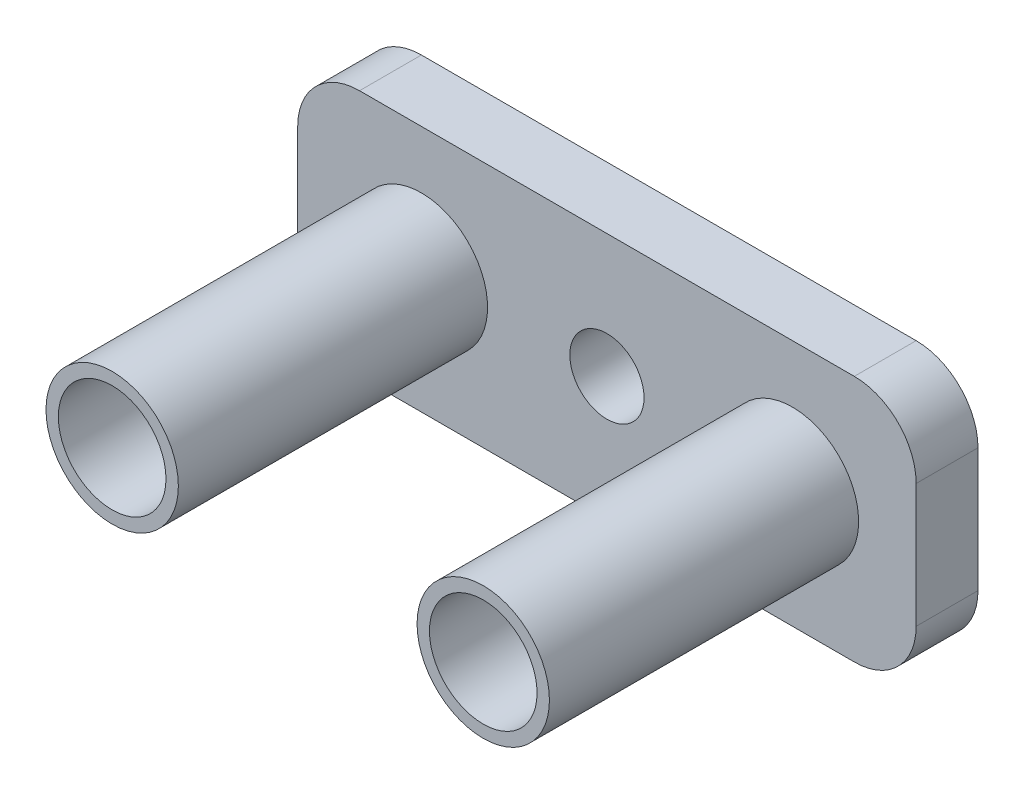
ISO-10303-21;
HEADER;
FILE_DESCRIPTION(('STEP AP214'),'2;1');
FILE_NAME('part.step','',(''),(''),'','','');
FILE_SCHEMA(('AUTOMOTIVE_DESIGN { 1 0 10303 214 1 1 1 1 }'));
ENDSEC;
DATA;
#1=APPLICATION_CONTEXT('core data for automotive mechanical design processes');
#2=APPLICATION_PROTOCOL_DEFINITION('international standard','automotive_design',2000,#1);
#3=PRODUCT_CONTEXT('',#1,'mechanical');
#4=PRODUCT('Part','Part','',(#3));
#5=PRODUCT_RELATED_PRODUCT_CATEGORY('part','',(#4));
#6=PRODUCT_DEFINITION_FORMATION('','',#4);
#7=PRODUCT_DEFINITION_CONTEXT('part definition',#1,'design');
#8=PRODUCT_DEFINITION('design','',#6,#7);
#9=PRODUCT_DEFINITION_SHAPE('','',#8);
#10=(LENGTH_UNIT() NAMED_UNIT(*) SI_UNIT(.MILLI.,.METRE.));
#11=(NAMED_UNIT(*) PLANE_ANGLE_UNIT() SI_UNIT($,.RADIAN.));
#12=(NAMED_UNIT(*) SI_UNIT($,.STERADIAN.) SOLID_ANGLE_UNIT());
#13=UNCERTAINTY_MEASURE_WITH_UNIT(LENGTH_MEASURE(1.E-05),#10,'distance_accuracy_value','');
#14=(GEOMETRIC_REPRESENTATION_CONTEXT(3) GLOBAL_UNCERTAINTY_ASSIGNED_CONTEXT((#13)) GLOBAL_UNIT_ASSIGNED_CONTEXT((#10,
#11,#12)) REPRESENTATION_CONTEXT('',''));
#15=CARTESIAN_POINT('',(0.,0.,0.));
#16=DIRECTION('',(0.,0.,1.));
#17=DIRECTION('',(1.,0.,0.));
#18=AXIS2_PLACEMENT_3D('',#15,#16,#17);
#19=CARTESIAN_POINT('',(-14.0298507462687,1.62313432835821,5.));
#20=DIRECTION('',(0.,0.,-1.));
#21=DIRECTION('',(-1.,0.,0.));
#22=AXIS2_PLACEMENT_3D('',#19,#20,#21);
#23=PLANE('',#22);
#24=CARTESIAN_POINT('',(20.9701492537313,-3.37686567164179,5.));
#25=DIRECTION('',(0.,0.,-1.));
#26=DIRECTION('',(-1.,0.,0.));
#27=AXIS2_PLACEMENT_3D('',#24,#25,#26);
#28=CIRCLE('',#27,5.35);
#29=CARTESIAN_POINT('',(15.6201492537314,-3.37686567164179,5.));
#30=VERTEX_POINT('',#29);
#31=EDGE_CURVE('E12',#30,#30,#28,.F.);
#32=ORIENTED_EDGE('',*,*,#31,.F.);
#33=EDGE_LOOP('',(#32));
#34=FACE_BOUND('',#33,.T.);
#35=CARTESIAN_POINT('',(-9.02985074626865,-3.37686567164179,5.));
#36=DIRECTION('',(0.,0.,-1.));
#37=DIRECTION('',(-1.,0.,0.));
#38=AXIS2_PLACEMENT_3D('',#35,#36,#37);
#39=CIRCLE('',#38,5.35);
#40=CARTESIAN_POINT('',(-14.3798507462686,-3.37686567164179,5.));
#41=VERTEX_POINT('',#40);
#42=EDGE_CURVE('E58',#41,#41,#39,.F.);
#43=ORIENTED_EDGE('',*,*,#42,.F.);
#44=EDGE_LOOP('',(#43));
#45=FACE_BOUND('',#44,.T.);
#46=CARTESIAN_POINT('',(-14.0298507462687,1.62313432835821,5.));
#47=DIRECTION('',(0.,0.,1.));
#48=DIRECTION('',(-1.,0.,0.));
#49=AXIS2_PLACEMENT_3D('',#46,#47,#48);
#50=CIRCLE('',#49,5.);
#51=CARTESIAN_POINT('',(-14.0298507462686,6.62313432835821,5.));
#52=VERTEX_POINT('',#51);
#53=CARTESIAN_POINT('',(-19.0298507462687,1.62313432835817,5.));
#54=VERTEX_POINT('',#53);
#55=EDGE_CURVE('E163',#52,#54,#50,.T.);
#56=ORIENTED_EDGE('',*,*,#55,.T.);
#57=DIRECTION('',(0.,-1.,0.));
#58=VECTOR('',#57,1.);
#59=CARTESIAN_POINT('',(-19.0298507462687,1.62313432835817,5.));
#60=LINE('',#59,#58);
#61=CARTESIAN_POINT('',(-19.0298507462687,-8.37686567164175,5.));
#62=VERTEX_POINT('',#61);
#63=EDGE_CURVE('E111',#54,#62,#60,.T.);
#64=ORIENTED_EDGE('',*,*,#63,.T.);
#65=CARTESIAN_POINT('',(-14.0298507462687,-8.37686567164179,5.));
#66=DIRECTION('',(0.,0.,1.));
#67=DIRECTION('',(-1.,0.,0.));
#68=AXIS2_PLACEMENT_3D('',#65,#66,#67);
#69=CIRCLE('',#68,5.);
#70=CARTESIAN_POINT('',(-14.0298507462686,-13.3768656716418,5.));
#71=VERTEX_POINT('',#70);
#72=EDGE_CURVE('E193',#62,#71,#69,.T.);
#73=ORIENTED_EDGE('',*,*,#72,.T.);
#74=DIRECTION('',(1.,0.,0.));
#75=VECTOR('',#74,1.);
#76=CARTESIAN_POINT('',(-14.0298507462686,-13.3768656716418,5.));
#77=LINE('',#76,#75);
#78=CARTESIAN_POINT('',(25.9701492537313,-13.3768656716418,5.));
#79=VERTEX_POINT('',#78);
#80=EDGE_CURVE('E195',#71,#79,#77,.T.);
#81=ORIENTED_EDGE('',*,*,#80,.T.);
#82=CARTESIAN_POINT('',(25.9701492537314,-8.37686567164179,5.));
#83=DIRECTION('',(0.,0.,1.));
#84=DIRECTION('',(1.,0.,0.));
#85=AXIS2_PLACEMENT_3D('',#82,#83,#84);
#86=CIRCLE('',#85,5.);
#87=CARTESIAN_POINT('',(30.9701492537314,-8.37686567164179,5.));
#88=VERTEX_POINT('',#87);
#89=EDGE_CURVE('E130',#79,#88,#86,.T.);
#90=ORIENTED_EDGE('',*,*,#89,.T.);
#91=DIRECTION('',(0.,1.,0.));
#92=VECTOR('',#91,1.);
#93=CARTESIAN_POINT('',(30.9701492537313,1.62313432835817,5.));
#94=LINE('',#93,#92);
#95=CARTESIAN_POINT('',(30.9701492537313,1.62313432835817,5.));
#96=VERTEX_POINT('',#95);
#97=EDGE_CURVE('E124',#88,#96,#94,.T.);
#98=ORIENTED_EDGE('',*,*,#97,.T.);
#99=CARTESIAN_POINT('',(25.9701492537313,1.62313432835821,5.));
#100=DIRECTION('',(0.,0.,1.));
#101=DIRECTION('',(1.,0.,0.));
#102=AXIS2_PLACEMENT_3D('',#99,#100,#101);
#103=CIRCLE('',#102,5.);
#104=CARTESIAN_POINT('',(25.9701492537313,6.62313432835821,5.));
#105=VERTEX_POINT('',#104);
#106=EDGE_CURVE('E128',#96,#105,#103,.T.);
#107=ORIENTED_EDGE('',*,*,#106,.T.);
#108=DIRECTION('',(-1.,0.,0.));
#109=VECTOR('',#108,1.);
#110=CARTESIAN_POINT('',(-14.0298507462686,6.62313432835821,5.));
#111=LINE('',#110,#109);
#112=EDGE_CURVE('E67',#105,#52,#111,.T.);
#113=ORIENTED_EDGE('',*,*,#112,.T.);
#114=EDGE_LOOP('',(#56,#64,#73,#81,#90,#98,#107,#113));
#115=FACE_BOUND('',#114,.T.);
#116=CARTESIAN_POINT('',(5.97014925373135,-3.37686567164179,5.));
#117=DIRECTION('',(0.,0.,1.));
#118=DIRECTION('',(1.,0.,0.));
#119=AXIS2_PLACEMENT_3D('',#116,#117,#118);
#120=CIRCLE('',#119,3.);
#121=CARTESIAN_POINT('',(8.97014925373134,-3.37686567164179,5.));
#122=VERTEX_POINT('',#121);
#123=EDGE_CURVE('E152',#122,#122,#120,.T.);
#124=ORIENTED_EDGE('',*,*,#123,.F.);
#125=EDGE_LOOP('',(#124));
#126=FACE_BOUND('',#125,.T.);
#127=ADVANCED_FACE('F48',(#34,#45,#115,#126),#23,.F.);
#128=CARTESIAN_POINT('',(-14.0298507462687,1.62313432835821,0.));
#129=DIRECTION('',(0.,0.,-1.));
#130=DIRECTION('',(-1.,0.,0.));
#131=AXIS2_PLACEMENT_3D('',#128,#129,#130);
#132=PLANE('',#131);
#133=CARTESIAN_POINT('',(-14.0298507462687,1.62313432835821,0.));
#134=DIRECTION('',(0.,0.,1.));
#135=DIRECTION('',(-1.,0.,0.));
#136=AXIS2_PLACEMENT_3D('',#133,#134,#135);
#137=CIRCLE('',#136,5.);
#138=CARTESIAN_POINT('',(-14.0298507462686,6.62313432835821,0.));
#139=VERTEX_POINT('',#138);
#140=CARTESIAN_POINT('',(-19.0298507462687,1.62313432835817,0.));
#141=VERTEX_POINT('',#140);
#142=EDGE_CURVE('E148',#139,#141,#137,.T.);
#143=ORIENTED_EDGE('',*,*,#142,.F.);
#144=DIRECTION('',(-1.,0.,0.));
#145=VECTOR('',#144,1.);
#146=CARTESIAN_POINT('',(-14.0298507462686,6.62313432835821,0.));
#147=LINE('',#146,#145);
#148=CARTESIAN_POINT('',(25.9701492537313,6.62313432835821,0.));
#149=VERTEX_POINT('',#148);
#150=EDGE_CURVE('E102',#149,#139,#147,.T.);
#151=ORIENTED_EDGE('',*,*,#150,.F.);
#152=CARTESIAN_POINT('',(25.9701492537313,1.62313432835821,0.));
#153=DIRECTION('',(0.,0.,1.));
#154=DIRECTION('',(1.,0.,0.));
#155=AXIS2_PLACEMENT_3D('',#152,#153,#154);
#156=CIRCLE('',#155,5.);
#157=CARTESIAN_POINT('',(30.9701492537313,1.62313432835817,0.));
#158=VERTEX_POINT('',#157);
#159=EDGE_CURVE('E96',#158,#149,#156,.T.);
#160=ORIENTED_EDGE('',*,*,#159,.F.);
#161=DIRECTION('',(0.,1.,0.));
#162=VECTOR('',#161,1.);
#163=CARTESIAN_POINT('',(30.9701492537313,1.62313432835817,0.));
#164=LINE('',#163,#162);
#165=CARTESIAN_POINT('',(30.9701492537314,-8.37686567164179,0.));
#166=VERTEX_POINT('',#165);
#167=EDGE_CURVE('E138',#166,#158,#164,.T.);
#168=ORIENTED_EDGE('',*,*,#167,.F.);
#169=CARTESIAN_POINT('',(25.9701492537314,-8.37686567164179,0.));
#170=DIRECTION('',(0.,0.,1.));
#171=DIRECTION('',(1.,0.,0.));
#172=AXIS2_PLACEMENT_3D('',#169,#170,#171);
#173=CIRCLE('',#172,5.);
#174=CARTESIAN_POINT('',(25.9701492537313,-13.3768656716418,0.));
#175=VERTEX_POINT('',#174);
#176=EDGE_CURVE('E158',#175,#166,#173,.T.);
#177=ORIENTED_EDGE('',*,*,#176,.F.);
#178=DIRECTION('',(1.,0.,0.));
#179=VECTOR('',#178,1.);
#180=CARTESIAN_POINT('',(-14.0298507462686,-13.3768656716418,0.));
#181=LINE('',#180,#179);
#182=CARTESIAN_POINT('',(-14.0298507462686,-13.3768656716418,0.));
#183=VERTEX_POINT('',#182);
#184=EDGE_CURVE('E156',#183,#175,#181,.T.);
#185=ORIENTED_EDGE('',*,*,#184,.F.);
#186=CARTESIAN_POINT('',(-14.0298507462687,-8.37686567164179,0.));
#187=DIRECTION('',(0.,0.,1.));
#188=DIRECTION('',(-1.,0.,0.));
#189=AXIS2_PLACEMENT_3D('',#186,#187,#188);
#190=CIRCLE('',#189,5.);
#191=CARTESIAN_POINT('',(-19.0298507462687,-8.37686567164175,0.));
#192=VERTEX_POINT('',#191);
#193=EDGE_CURVE('E154',#192,#183,#190,.T.);
#194=ORIENTED_EDGE('',*,*,#193,.F.);
#195=DIRECTION('',(0.,-1.,0.));
#196=VECTOR('',#195,1.);
#197=CARTESIAN_POINT('',(-19.0298507462687,1.62313432835817,0.));
#198=LINE('',#197,#196);
#199=EDGE_CURVE('E151',#141,#192,#198,.T.);
#200=ORIENTED_EDGE('',*,*,#199,.F.);
#201=EDGE_LOOP('',(#143,#151,#160,#168,#177,#185,#194,#200));
#202=FACE_BOUND('',#201,.T.);
#203=CARTESIAN_POINT('',(5.97014925373135,-3.37686567164179,0.));
#204=DIRECTION('',(0.,0.,1.));
#205=DIRECTION('',(1.,0.,0.));
#206=AXIS2_PLACEMENT_3D('',#203,#204,#205);
#207=CIRCLE('',#206,3.);
#208=CARTESIAN_POINT('',(8.97014925373134,-3.37686567164179,0.));
#209=VERTEX_POINT('',#208);
#210=EDGE_CURVE('E188',#209,#209,#207,.T.);
#211=ORIENTED_EDGE('',*,*,#210,.T.);
#212=EDGE_LOOP('',(#211));
#213=FACE_BOUND('',#212,.T.);
#214=ADVANCED_FACE('F207',(#202,#213),#132,.T.);
#215=CARTESIAN_POINT('',(-14.0298507462687,1.62313432835821,5.));
#216=DIRECTION('',(0.,0.,-1.));
#217=DIRECTION('',(-1.,0.,0.));
#218=AXIS2_PLACEMENT_3D('',#215,#216,#217);
#219=CYLINDRICAL_SURFACE('',#218,5.);
#220=ORIENTED_EDGE('',*,*,#142,.T.);
#221=DIRECTION('',(0.,0.,-1.));
#222=VECTOR('',#221,1.);
#223=CARTESIAN_POINT('',(-19.0298507462687,1.62313432835817,5.));
#224=LINE('',#223,#222);
#225=EDGE_CURVE('E52',#54,#141,#224,.T.);
#226=ORIENTED_EDGE('',*,*,#225,.F.);
#227=ORIENTED_EDGE('',*,*,#55,.F.);
#228=DIRECTION('',(0.,0.,-1.));
#229=VECTOR('',#228,1.);
#230=CARTESIAN_POINT('',(-14.0298507462686,6.62313432835821,5.));
#231=LINE('',#230,#229);
#232=EDGE_CURVE('E144',#52,#139,#231,.T.);
#233=ORIENTED_EDGE('',*,*,#232,.T.);
#234=EDGE_LOOP('',(#220,#226,#227,#233));
#235=FACE_BOUND('',#234,.T.);
#236=ADVANCED_FACE('F50',(#235),#219,.T.);
#237=CARTESIAN_POINT('',(-19.0298507462687,1.62313432835817,5.));
#238=DIRECTION('',(1.,0.,0.));
#239=DIRECTION('',(0.,1.,0.));
#240=AXIS2_PLACEMENT_3D('',#237,#238,#239);
#241=PLANE('',#240);
#242=ORIENTED_EDGE('',*,*,#199,.T.);
#243=DIRECTION('',(0.,0.,-1.));
#244=VECTOR('',#243,1.);
#245=CARTESIAN_POINT('',(-19.0298507462687,-8.37686567164175,5.));
#246=LINE('',#245,#244);
#247=EDGE_CURVE('E172',#62,#192,#246,.T.);
#248=ORIENTED_EDGE('',*,*,#247,.F.);
#249=ORIENTED_EDGE('',*,*,#63,.F.);
#250=ORIENTED_EDGE('',*,*,#225,.T.);
#251=EDGE_LOOP('',(#242,#248,#249,#250));
#252=FACE_BOUND('',#251,.T.);
#253=ADVANCED_FACE('F417',(#252),#241,.F.);
#254=CARTESIAN_POINT('',(-14.0298507462687,-8.37686567164179,5.));
#255=DIRECTION('',(0.,0.,-1.));
#256=DIRECTION('',(-1.,0.,0.));
#257=AXIS2_PLACEMENT_3D('',#254,#255,#256);
#258=CYLINDRICAL_SURFACE('',#257,5.);
#259=ORIENTED_EDGE('',*,*,#193,.T.);
#260=DIRECTION('',(0.,0.,-1.));
#261=VECTOR('',#260,1.);
#262=CARTESIAN_POINT('',(-14.0298507462686,-13.3768656716418,5.));
#263=LINE('',#262,#261);
#264=EDGE_CURVE('E170',#71,#183,#263,.T.);
#265=ORIENTED_EDGE('',*,*,#264,.F.);
#266=ORIENTED_EDGE('',*,*,#72,.F.);
#267=ORIENTED_EDGE('',*,*,#247,.T.);
#268=EDGE_LOOP('',(#259,#265,#266,#267));
#269=FACE_BOUND('',#268,.T.);
#270=ADVANCED_FACE('F408',(#269),#258,.T.);
#271=CARTESIAN_POINT('',(-14.0298507462686,-13.3768656716418,5.));
#272=DIRECTION('',(0.,1.,0.));
#273=DIRECTION('',(0.,0.,1.));
#274=AXIS2_PLACEMENT_3D('',#271,#272,#273);
#275=PLANE('',#274);
#276=ORIENTED_EDGE('',*,*,#184,.T.);
#277=DIRECTION('',(0.,0.,-1.));
#278=VECTOR('',#277,1.);
#279=CARTESIAN_POINT('',(25.9701492537313,-13.3768656716418,5.));
#280=LINE('',#279,#278);
#281=EDGE_CURVE('E167',#79,#175,#280,.T.);
#282=ORIENTED_EDGE('',*,*,#281,.F.);
#283=ORIENTED_EDGE('',*,*,#80,.F.);
#284=ORIENTED_EDGE('',*,*,#264,.T.);
#285=EDGE_LOOP('',(#276,#282,#283,#284));
#286=FACE_BOUND('',#285,.T.);
#287=ADVANCED_FACE('F200',(#286),#275,.F.);
#288=CARTESIAN_POINT('',(25.9701492537314,-8.37686567164179,5.));
#289=DIRECTION('',(0.,0.,-1.));
#290=DIRECTION('',(-1.,0.,0.));
#291=AXIS2_PLACEMENT_3D('',#288,#289,#290);
#292=CYLINDRICAL_SURFACE('',#291,5.);
#293=ORIENTED_EDGE('',*,*,#176,.T.);
#294=DIRECTION('',(0.,0.,-1.));
#295=VECTOR('',#294,1.);
#296=CARTESIAN_POINT('',(30.9701492537314,-8.37686567164179,5.));
#297=LINE('',#296,#295);
#298=EDGE_CURVE('E139',#88,#166,#297,.T.);
#299=ORIENTED_EDGE('',*,*,#298,.F.);
#300=ORIENTED_EDGE('',*,*,#89,.F.);
#301=ORIENTED_EDGE('',*,*,#281,.T.);
#302=EDGE_LOOP('',(#293,#299,#300,#301));
#303=FACE_BOUND('',#302,.T.);
#304=ADVANCED_FACE('F204',(#303),#292,.T.);
#305=CARTESIAN_POINT('',(30.9701492537313,1.62313432835817,5.));
#306=DIRECTION('',(-1.,0.,0.));
#307=DIRECTION('',(0.,-1.,0.));
#308=AXIS2_PLACEMENT_3D('',#305,#306,#307);
#309=PLANE('',#308);
#310=ORIENTED_EDGE('',*,*,#167,.T.);
#311=DIRECTION('',(0.,0.,-1.));
#312=VECTOR('',#311,1.);
#313=CARTESIAN_POINT('',(30.9701492537313,1.62313432835817,5.));
#314=LINE('',#313,#312);
#315=EDGE_CURVE('E135',#96,#158,#314,.T.);
#316=ORIENTED_EDGE('',*,*,#315,.F.);
#317=ORIENTED_EDGE('',*,*,#97,.F.);
#318=ORIENTED_EDGE('',*,*,#298,.T.);
#319=EDGE_LOOP('',(#310,#316,#317,#318));
#320=FACE_BOUND('',#319,.T.);
#321=ADVANCED_FACE('F136',(#320),#309,.F.);
#322=CARTESIAN_POINT('',(25.9701492537313,1.62313432835821,5.));
#323=DIRECTION('',(0.,0.,-1.));
#324=DIRECTION('',(-1.,0.,0.));
#325=AXIS2_PLACEMENT_3D('',#322,#323,#324);
#326=CYLINDRICAL_SURFACE('',#325,5.);
#327=ORIENTED_EDGE('',*,*,#159,.T.);
#328=DIRECTION('',(0.,0.,-1.));
#329=VECTOR('',#328,1.);
#330=CARTESIAN_POINT('',(25.9701492537313,6.62313432835821,5.));
#331=LINE('',#330,#329);
#332=EDGE_CURVE('E140',#105,#149,#331,.T.);
#333=ORIENTED_EDGE('',*,*,#332,.F.);
#334=ORIENTED_EDGE('',*,*,#106,.F.);
#335=ORIENTED_EDGE('',*,*,#315,.T.);
#336=EDGE_LOOP('',(#327,#333,#334,#335));
#337=FACE_BOUND('',#336,.T.);
#338=ADVANCED_FACE('F142',(#337),#326,.T.);
#339=CARTESIAN_POINT('',(-14.0298507462686,6.62313432835821,5.));
#340=DIRECTION('',(0.,-1.,0.));
#341=DIRECTION('',(0.,0.,-1.));
#342=AXIS2_PLACEMENT_3D('',#339,#340,#341);
#343=PLANE('',#342);
#344=ORIENTED_EDGE('',*,*,#150,.T.);
#345=ORIENTED_EDGE('',*,*,#232,.F.);
#346=ORIENTED_EDGE('',*,*,#112,.F.);
#347=ORIENTED_EDGE('',*,*,#332,.T.);
#348=EDGE_LOOP('',(#344,#345,#346,#347));
#349=FACE_BOUND('',#348,.T.);
#350=ADVANCED_FACE('F211',(#349),#343,.F.);
#351=CARTESIAN_POINT('',(5.97014925373135,-3.37686567164179,5.));
#352=DIRECTION('',(0.,0.,-1.));
#353=DIRECTION('',(-1.,0.,0.));
#354=AXIS2_PLACEMENT_3D('',#351,#352,#353);
#355=CYLINDRICAL_SURFACE('',#354,3.);
#356=ORIENTED_EDGE('',*,*,#123,.T.);
#357=EDGE_LOOP('',(#356));
#358=FACE_BOUND('',#357,.T.);
#359=ORIENTED_EDGE('',*,*,#210,.F.);
#360=EDGE_LOOP('',(#359));
#361=FACE_BOUND('',#360,.T.);
#362=ADVANCED_FACE('F213',(#358,#361),#355,.F.);
#363=CARTESIAN_POINT('',(-9.02985074626865,-3.37686567164179,30.));
#364=DIRECTION('',(0.,0.,-1.));
#365=DIRECTION('',(-1.,0.,0.));
#366=AXIS2_PLACEMENT_3D('',#363,#364,#365);
#367=CYLINDRICAL_SURFACE('',#366,5.35);
#368=CARTESIAN_POINT('',(-9.02985074626865,-3.37686567164179,30.));
#369=DIRECTION('',(0.,0.,1.));
#370=DIRECTION('',(1.,0.,0.));
#371=AXIS2_PLACEMENT_3D('',#368,#369,#370);
#372=CIRCLE('',#371,5.35);
#373=CARTESIAN_POINT('',(-3.67985074626865,-3.37686567164179,30.));
#374=VERTEX_POINT('',#373);
#375=EDGE_CURVE('E254',#374,#374,#372,.T.);
#376=ORIENTED_EDGE('',*,*,#375,.F.);
#377=EDGE_LOOP('',(#376));
#378=FACE_BOUND('',#377,.T.);
#379=ORIENTED_EDGE('',*,*,#42,.T.);
#380=EDGE_LOOP('',(#379));
#381=FACE_BOUND('',#380,.T.);
#382=ADVANCED_FACE('F219',(#378,#381),#367,.T.);
#383=CARTESIAN_POINT('',(-9.02985074626865,-3.37686567164179,30.));
#384=DIRECTION('',(0.,0.,-1.));
#385=DIRECTION('',(-1.,0.,0.));
#386=AXIS2_PLACEMENT_3D('',#383,#384,#385);
#387=CYLINDRICAL_SURFACE('',#386,4.35);
#388=CARTESIAN_POINT('',(-9.02985074626865,-3.37686567164179,30.));
#389=DIRECTION('',(0.,0.,1.));
#390=DIRECTION('',(1.,0.,0.));
#391=AXIS2_PLACEMENT_3D('',#388,#389,#390);
#392=CIRCLE('',#391,4.35);
#393=CARTESIAN_POINT('',(-4.67985074626865,-3.37686567164179,30.));
#394=VERTEX_POINT('',#393);
#395=EDGE_CURVE('E256',#394,#394,#392,.T.);
#396=ORIENTED_EDGE('',*,*,#395,.T.);
#397=EDGE_LOOP('',(#396));
#398=FACE_BOUND('',#397,.T.);
#399=CARTESIAN_POINT('',(-9.02985074626865,-3.37686567164179,5.));
#400=DIRECTION('',(0.,0.,-1.));
#401=DIRECTION('',(-1.,0.,0.));
#402=AXIS2_PLACEMENT_3D('',#399,#400,#401);
#403=CIRCLE('',#402,4.35);
#404=CARTESIAN_POINT('',(-13.3798507462687,-3.37686567164179,5.));
#405=VERTEX_POINT('',#404);
#406=EDGE_CURVE('E184',#405,#405,#403,.F.);
#407=ORIENTED_EDGE('',*,*,#406,.F.);
#408=EDGE_LOOP('',(#407));
#409=FACE_BOUND('',#408,.T.);
#410=ADVANCED_FACE('F248',(#398,#409),#387,.F.);
#411=CARTESIAN_POINT('',(-9.02985074626865,-3.37686567164179,30.));
#412=DIRECTION('',(0.,0.,1.));
#413=DIRECTION('',(1.,0.,0.));
#414=AXIS2_PLACEMENT_3D('',#411,#412,#413);
#415=PLANE('',#414);
#416=ORIENTED_EDGE('',*,*,#375,.T.);
#417=EDGE_LOOP('',(#416));
#418=FACE_BOUND('',#417,.T.);
#419=ORIENTED_EDGE('',*,*,#395,.F.);
#420=EDGE_LOOP('',(#419));
#421=FACE_BOUND('',#420,.T.);
#422=ADVANCED_FACE('F239',(#418,#421),#415,.T.);
#423=ORIENTED_EDGE('',*,*,#406,.T.);
#424=EDGE_LOOP('',(#423));
#425=FACE_BOUND('',#424,.T.);
#426=ADVANCED_FACE('F228',(#425),#23,.F.);
#427=CARTESIAN_POINT('',(20.9701492537313,-3.37686567164179,30.));
#428=DIRECTION('',(0.,0.,-1.));
#429=DIRECTION('',(-1.,0.,0.));
#430=AXIS2_PLACEMENT_3D('',#427,#428,#429);
#431=CYLINDRICAL_SURFACE('',#430,5.35);
#432=CARTESIAN_POINT('',(20.9701492537313,-3.37686567164179,30.));
#433=DIRECTION('',(0.,0.,1.));
#434=DIRECTION('',(1.,0.,0.));
#435=AXIS2_PLACEMENT_3D('',#432,#433,#434);
#436=CIRCLE('',#435,5.35);
#437=CARTESIAN_POINT('',(26.3201492537313,-3.37686567164179,30.));
#438=VERTEX_POINT('',#437);
#439=EDGE_CURVE('E264',#438,#438,#436,.T.);
#440=ORIENTED_EDGE('',*,*,#439,.F.);
#441=EDGE_LOOP('',(#440));
#442=FACE_BOUND('',#441,.T.);
#443=ORIENTED_EDGE('',*,*,#31,.T.);
#444=EDGE_LOOP('',(#443));
#445=FACE_BOUND('',#444,.T.);
#446=ADVANCED_FACE('F238',(#442,#445),#431,.T.);
#447=CARTESIAN_POINT('',(20.9701492537313,-3.37686567164179,30.));
#448=DIRECTION('',(0.,0.,-1.));
#449=DIRECTION('',(-1.,0.,0.));
#450=AXIS2_PLACEMENT_3D('',#447,#448,#449);
#451=CYLINDRICAL_SURFACE('',#450,4.35);
#452=CARTESIAN_POINT('',(20.9701492537313,-3.37686567164179,30.));
#453=DIRECTION('',(0.,0.,1.));
#454=DIRECTION('',(1.,0.,0.));
#455=AXIS2_PLACEMENT_3D('',#452,#453,#454);
#456=CIRCLE('',#455,4.35);
#457=CARTESIAN_POINT('',(25.3201492537313,-3.37686567164179,30.));
#458=VERTEX_POINT('',#457);
#459=EDGE_CURVE('E267',#458,#458,#456,.T.);
#460=ORIENTED_EDGE('',*,*,#459,.T.);
#461=EDGE_LOOP('',(#460));
#462=FACE_BOUND('',#461,.T.);
#463=CARTESIAN_POINT('',(20.9701492537313,-3.37686567164179,5.));
#464=DIRECTION('',(0.,0.,-1.));
#465=DIRECTION('',(-1.,0.,0.));
#466=AXIS2_PLACEMENT_3D('',#463,#464,#465);
#467=CIRCLE('',#466,4.35);
#468=CARTESIAN_POINT('',(16.6201492537313,-3.37686567164179,5.));
#469=VERTEX_POINT('',#468);
#470=EDGE_CURVE('E259',#469,#469,#467,.F.);
#471=ORIENTED_EDGE('',*,*,#470,.F.);
#472=EDGE_LOOP('',(#471));
#473=FACE_BOUND('',#472,.T.);
#474=ADVANCED_FACE('F245',(#462,#473),#451,.F.);
#475=CARTESIAN_POINT('',(20.9701492537313,-3.37686567164179,30.));
#476=DIRECTION('',(0.,0.,1.));
#477=DIRECTION('',(1.,0.,0.));
#478=AXIS2_PLACEMENT_3D('',#475,#476,#477);
#479=PLANE('',#478);
#480=ORIENTED_EDGE('',*,*,#439,.T.);
#481=EDGE_LOOP('',(#480));
#482=FACE_BOUND('',#481,.T.);
#483=ORIENTED_EDGE('',*,*,#459,.F.);
#484=EDGE_LOOP('',(#483));
#485=FACE_BOUND('',#484,.T.);
#486=ADVANCED_FACE('F235',(#482,#485),#479,.T.);
#487=ORIENTED_EDGE('',*,*,#470,.T.);
#488=EDGE_LOOP('',(#487));
#489=FACE_BOUND('',#488,.T.);
#490=ADVANCED_FACE('F227',(#489),#23,.F.);
#491=CLOSED_SHELL('',(#127,#214,#236,#253,#270,#287,#304,#321,#338,#350,#362,#382,#410,#422,
#426,#446,#474,#486,#490));
#492=MANIFOLD_SOLID_BREP('B2',#491);
#493=ADVANCED_BREP_SHAPE_REPRESENTATION('',(#18,#492),#14);
#494=SHAPE_DEFINITION_REPRESENTATION(#9,#493);
ENDSEC;
END-ISO-10303-21;
